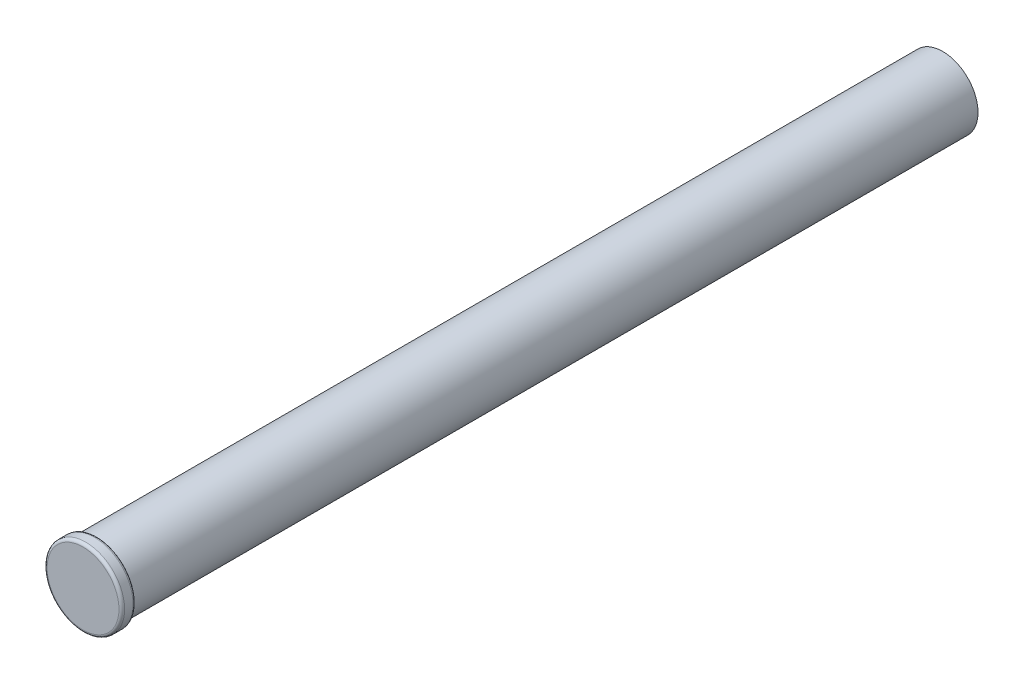
ISO-10303-21;
HEADER;
FILE_DESCRIPTION(('STEP AP214'),'2;1');
FILE_NAME('part.step','',(''),(''),'','','');
FILE_SCHEMA(('AUTOMOTIVE_DESIGN { 1 0 10303 214 1 1 1 1 }'));
ENDSEC;
DATA;
#1=APPLICATION_CONTEXT('core data for automotive mechanical design processes');
#2=APPLICATION_PROTOCOL_DEFINITION('international standard','automotive_design',2000,#1);
#3=PRODUCT_CONTEXT('',#1,'mechanical');
#4=PRODUCT('Part','Part','',(#3));
#5=PRODUCT_RELATED_PRODUCT_CATEGORY('part','',(#4));
#6=PRODUCT_DEFINITION_FORMATION('','',#4);
#7=PRODUCT_DEFINITION_CONTEXT('part definition',#1,'design');
#8=PRODUCT_DEFINITION('design','',#6,#7);
#9=PRODUCT_DEFINITION_SHAPE('','',#8);
#10=(LENGTH_UNIT() NAMED_UNIT(*) SI_UNIT(.MILLI.,.METRE.));
#11=(NAMED_UNIT(*) PLANE_ANGLE_UNIT() SI_UNIT($,.RADIAN.));
#12=(NAMED_UNIT(*) SI_UNIT($,.STERADIAN.) SOLID_ANGLE_UNIT());
#13=UNCERTAINTY_MEASURE_WITH_UNIT(LENGTH_MEASURE(1.E-05),#10,'distance_accuracy_value','');
#14=(GEOMETRIC_REPRESENTATION_CONTEXT(3) GLOBAL_UNCERTAINTY_ASSIGNED_CONTEXT((#13)) GLOBAL_UNIT_ASSIGNED_CONTEXT((#10,
#11,#12)) REPRESENTATION_CONTEXT('',''));
#15=CARTESIAN_POINT('',(0.,0.,0.));
#16=DIRECTION('',(0.,0.,1.));
#17=DIRECTION('',(1.,0.,0.));
#18=AXIS2_PLACEMENT_3D('',#15,#16,#17);
#19=CARTESIAN_POINT('',(0.,0.,30.));
#20=DIRECTION('',(0.,0.,-1.));
#21=DIRECTION('',(-1.,0.,0.));
#22=AXIS2_PLACEMENT_3D('',#19,#20,#21);
#23=CYLINDRICAL_SURFACE('',#22,1.25);
#24=CARTESIAN_POINT('',(0.,0.,30.));
#25=DIRECTION('',(0.,0.,1.));
#26=DIRECTION('',(1.,0.,0.));
#27=AXIS2_PLACEMENT_3D('',#24,#25,#26);
#28=CIRCLE('',#27,1.25);
#29=CARTESIAN_POINT('',(1.25,0.,30.));
#30=VERTEX_POINT('',#29);
#31=EDGE_CURVE('E58',#30,#30,#28,.T.);
#32=ORIENTED_EDGE('',*,*,#31,.F.);
#33=EDGE_LOOP('',(#32));
#34=FACE_BOUND('',#33,.T.);
#35=CARTESIAN_POINT('',(0.,0.,0.));
#36=DIRECTION('',(0.,0.,1.));
#37=DIRECTION('',(1.,0.,0.));
#38=AXIS2_PLACEMENT_3D('',#35,#36,#37);
#39=CIRCLE('',#38,1.25);
#40=CARTESIAN_POINT('',(1.25,0.,0.));
#41=VERTEX_POINT('',#40);
#42=EDGE_CURVE('E59',#41,#41,#39,.T.);
#43=ORIENTED_EDGE('',*,*,#42,.T.);
#44=EDGE_LOOP('',(#43));
#45=FACE_BOUND('',#44,.T.);
#46=ADVANCED_FACE('F38',(#34,#45),#23,.T.);
#47=CARTESIAN_POINT('',(0.,0.,0.));
#48=DIRECTION('',(0.,0.,1.));
#49=DIRECTION('',(1.,0.,0.));
#50=AXIS2_PLACEMENT_3D('',#47,#48,#49);
#51=PLANE('',#50);
#52=ORIENTED_EDGE('',*,*,#42,.F.);
#53=EDGE_LOOP('',(#52));
#54=FACE_BOUND('',#53,.T.);
#55=ADVANCED_FACE('F69',(#54),#51,.F.);
#56=CARTESIAN_POINT('',(0.,0.,30.5));
#57=DIRECTION('',(0.,0.,-1.));
#58=DIRECTION('',(-1.,0.,0.));
#59=AXIS2_PLACEMENT_3D('',#56,#57,#58);
#60=CYLINDRICAL_SURFACE('',#59,1.375);
#61=CARTESIAN_POINT('',(0.,0.,30.1));
#62=DIRECTION('',(0.,0.,1.));
#63=DIRECTION('',(1.,0.,0.));
#64=AXIS2_PLACEMENT_3D('',#61,#62,#63);
#65=CIRCLE('',#64,1.375);
#66=CARTESIAN_POINT('',(1.375,0.,30.1));
#67=VERTEX_POINT('',#66);
#68=EDGE_CURVE('E49',#67,#67,#65,.T.);
#69=ORIENTED_EDGE('',*,*,#68,.T.);
#70=EDGE_LOOP('',(#69));
#71=FACE_BOUND('',#70,.T.);
#72=CARTESIAN_POINT('',(0.,0.,30.4));
#73=DIRECTION('',(0.,0.,1.));
#74=DIRECTION('',(1.,0.,0.));
#75=AXIS2_PLACEMENT_3D('',#72,#73,#74);
#76=CIRCLE('',#75,1.375);
#77=CARTESIAN_POINT('',(1.375,0.,30.4));
#78=VERTEX_POINT('',#77);
#79=EDGE_CURVE('E53',#78,#78,#76,.F.);
#80=ORIENTED_EDGE('',*,*,#79,.T.);
#81=EDGE_LOOP('',(#80));
#82=FACE_BOUND('',#81,.T.);
#83=ADVANCED_FACE('F74',(#71,#82),#60,.T.);
#84=CARTESIAN_POINT('',(0.,0.,30.5));
#85=DIRECTION('',(0.,0.,1.));
#86=DIRECTION('',(1.,0.,0.));
#87=AXIS2_PLACEMENT_3D('',#84,#85,#86);
#88=PLANE('',#87);
#89=CARTESIAN_POINT('',(0.,0.,30.5));
#90=DIRECTION('',(0.,0.,1.));
#91=DIRECTION('',(1.,0.,0.));
#92=AXIS2_PLACEMENT_3D('',#89,#90,#91);
#93=CIRCLE('',#92,1.275);
#94=CARTESIAN_POINT('',(1.275,0.,30.5));
#95=VERTEX_POINT('',#94);
#96=EDGE_CURVE('E10',#95,#95,#93,.T.);
#97=ORIENTED_EDGE('',*,*,#96,.T.);
#98=EDGE_LOOP('',(#97));
#99=FACE_BOUND('',#98,.T.);
#100=ADVANCED_FACE('F79',(#99),#88,.T.);
#101=CARTESIAN_POINT('',(0.,0.,30.));
#102=DIRECTION('',(0.,0.,1.));
#103=DIRECTION('',(1.,0.,0.));
#104=AXIS2_PLACEMENT_3D('',#101,#102,#103);
#105=PLANE('',#104);
#106=CARTESIAN_POINT('',(0.,0.,30.));
#107=DIRECTION('',(0.,0.,1.));
#108=DIRECTION('',(1.,0.,0.));
#109=AXIS2_PLACEMENT_3D('',#106,#107,#108);
#110=CIRCLE('',#109,1.275);
#111=CARTESIAN_POINT('',(1.275,0.,30.));
#112=VERTEX_POINT('',#111);
#113=EDGE_CURVE('E45',#112,#112,#110,.F.);
#114=ORIENTED_EDGE('',*,*,#113,.T.);
#115=EDGE_LOOP('',(#114));
#116=FACE_BOUND('',#115,.T.);
#117=ORIENTED_EDGE('',*,*,#31,.T.);
#118=EDGE_LOOP('',(#117));
#119=FACE_BOUND('',#118,.T.);
#120=ADVANCED_FACE('F65',(#116,#119),#105,.F.);
#121=CARTESIAN_POINT('',(0.,0.,30.1));
#122=DIRECTION('',(0.,0.,1.));
#123=DIRECTION('',(1.,0.,0.));
#124=AXIS2_PLACEMENT_3D('',#121,#122,#123);
#125=TOROIDAL_SURFACE('',#124,1.275,0.1);
#126=ORIENTED_EDGE('',*,*,#113,.F.);
#127=EDGE_LOOP('',(#126));
#128=FACE_BOUND('',#127,.T.);
#129=ORIENTED_EDGE('',*,*,#68,.F.);
#130=EDGE_LOOP('',(#129));
#131=FACE_BOUND('',#130,.T.);
#132=ADVANCED_FACE('F83',(#128,#131),#125,.T.);
#133=CARTESIAN_POINT('',(0.,0.,30.4));
#134=DIRECTION('',(0.,0.,1.));
#135=DIRECTION('',(1.,0.,0.));
#136=AXIS2_PLACEMENT_3D('',#133,#134,#135);
#137=TOROIDAL_SURFACE('',#136,1.275,0.1);
#138=ORIENTED_EDGE('',*,*,#79,.F.);
#139=EDGE_LOOP('',(#138));
#140=FACE_BOUND('',#139,.T.);
#141=ORIENTED_EDGE('',*,*,#96,.F.);
#142=EDGE_LOOP('',(#141));
#143=FACE_BOUND('',#142,.T.);
#144=ADVANCED_FACE('F40',(#140,#143),#137,.T.);
#145=CLOSED_SHELL('',(#46,#55,#83,#100,#120,#132,#144));
#146=MANIFOLD_SOLID_BREP('B2',#145);
#147=ADVANCED_BREP_SHAPE_REPRESENTATION('',(#18,#146),#14);
#148=SHAPE_DEFINITION_REPRESENTATION(#9,#147);
ENDSEC;
END-ISO-10303-21;
